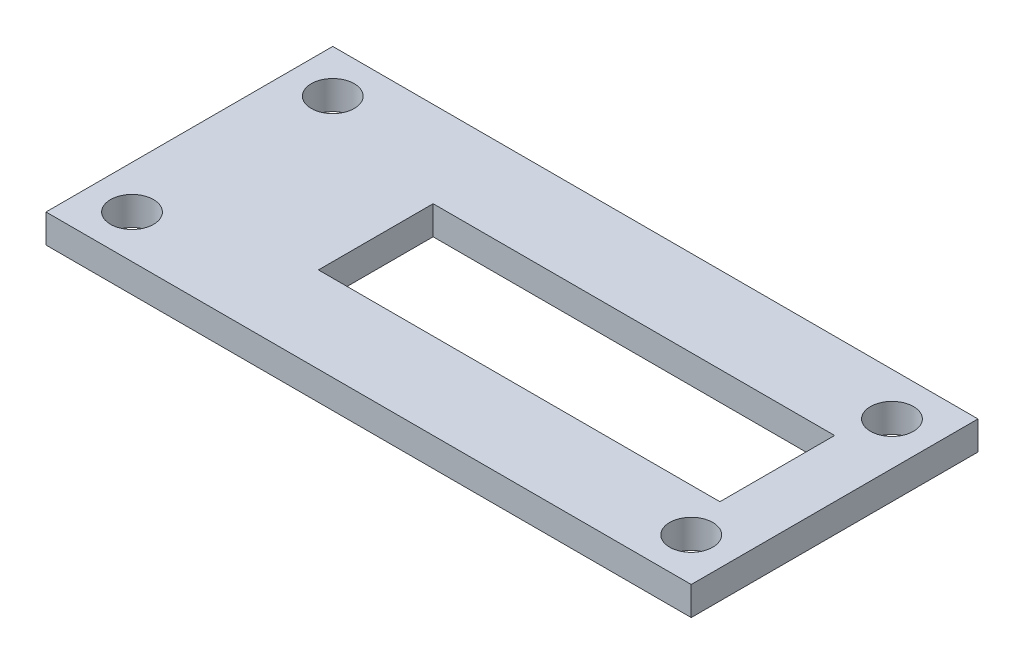
ISO-10303-21;
HEADER;
FILE_DESCRIPTION(('STEP AP214'),'2;1');
FILE_NAME('part.step','',(''),(''),'','','');
FILE_SCHEMA(('AUTOMOTIVE_DESIGN { 1 0 10303 214 1 1 1 1 }'));
ENDSEC;
DATA;
#1=APPLICATION_CONTEXT('core data for automotive mechanical design processes');
#2=APPLICATION_PROTOCOL_DEFINITION('international standard','automotive_design',2000,#1);
#3=PRODUCT_CONTEXT('',#1,'mechanical');
#4=PRODUCT('Part','Part','',(#3));
#5=PRODUCT_RELATED_PRODUCT_CATEGORY('part','',(#4));
#6=PRODUCT_DEFINITION_FORMATION('','',#4);
#7=PRODUCT_DEFINITION_CONTEXT('part definition',#1,'design');
#8=PRODUCT_DEFINITION('design','',#6,#7);
#9=PRODUCT_DEFINITION_SHAPE('','',#8);
#10=(LENGTH_UNIT() NAMED_UNIT(*) SI_UNIT(.MILLI.,.METRE.));
#11=(NAMED_UNIT(*) PLANE_ANGLE_UNIT() SI_UNIT($,.RADIAN.));
#12=(NAMED_UNIT(*) SI_UNIT($,.STERADIAN.) SOLID_ANGLE_UNIT());
#13=UNCERTAINTY_MEASURE_WITH_UNIT(LENGTH_MEASURE(1.E-05),#10,'distance_accuracy_value','');
#14=(GEOMETRIC_REPRESENTATION_CONTEXT(3) GLOBAL_UNCERTAINTY_ASSIGNED_CONTEXT((#13)) GLOBAL_UNIT_ASSIGNED_CONTEXT((#10,
#11,#12)) REPRESENTATION_CONTEXT('',''));
#15=CARTESIAN_POINT('',(0.,0.,0.));
#16=DIRECTION('',(0.,0.,1.));
#17=DIRECTION('',(1.,0.,0.));
#18=AXIS2_PLACEMENT_3D('',#15,#16,#17);
#19=CARTESIAN_POINT('',(22.5,2.,10.));
#20=DIRECTION('',(-1.,0.,0.));
#21=DIRECTION('',(0.,0.,1.));
#22=AXIS2_PLACEMENT_3D('',#19,#20,#21);
#23=PLANE('',#22);
#24=DIRECTION('',(0.,0.,-1.));
#25=VECTOR('',#24,1.);
#26=CARTESIAN_POINT('',(22.5,0.,10.));
#27=LINE('',#26,#25);
#28=CARTESIAN_POINT('',(22.5,0.,10.));
#29=VERTEX_POINT('',#28);
#30=CARTESIAN_POINT('',(22.5,0.,-10.));
#31=VERTEX_POINT('',#30);
#32=EDGE_CURVE('E155',#29,#31,#27,.T.);
#33=ORIENTED_EDGE('',*,*,#32,.T.);
#34=DIRECTION('',(0.,-1.,0.));
#35=VECTOR('',#34,1.);
#36=CARTESIAN_POINT('',(22.5,2.,-10.));
#37=LINE('',#36,#35);
#38=CARTESIAN_POINT('',(22.5,2.,-10.));
#39=VERTEX_POINT('',#38);
#40=EDGE_CURVE('E11',#39,#31,#37,.T.);
#41=ORIENTED_EDGE('',*,*,#40,.F.);
#42=DIRECTION('',(0.,0.,-1.));
#43=VECTOR('',#42,1.);
#44=CARTESIAN_POINT('',(22.5,2.,10.));
#45=LINE('',#44,#43);
#46=CARTESIAN_POINT('',(22.5,2.,10.));
#47=VERTEX_POINT('',#46);
#48=EDGE_CURVE('E158',#47,#39,#45,.T.);
#49=ORIENTED_EDGE('',*,*,#48,.F.);
#50=DIRECTION('',(0.,-1.,0.));
#51=VECTOR('',#50,1.);
#52=CARTESIAN_POINT('',(22.5,2.,10.));
#53=LINE('',#52,#51);
#54=EDGE_CURVE('E168',#47,#29,#53,.T.);
#55=ORIENTED_EDGE('',*,*,#54,.T.);
#56=EDGE_LOOP('',(#33,#41,#49,#55));
#57=FACE_BOUND('',#56,.T.);
#58=ADVANCED_FACE('F33',(#57),#23,.F.);
#59=CARTESIAN_POINT('',(-22.5,2.,-10.));
#60=DIRECTION('',(0.,0.,1.));
#61=DIRECTION('',(1.,0.,0.));
#62=AXIS2_PLACEMENT_3D('',#59,#60,#61);
#63=PLANE('',#62);
#64=DIRECTION('',(-1.,0.,0.));
#65=VECTOR('',#64,1.);
#66=CARTESIAN_POINT('',(-22.5,0.,-10.));
#67=LINE('',#66,#65);
#68=CARTESIAN_POINT('',(-22.5,0.,-10.));
#69=VERTEX_POINT('',#68);
#70=EDGE_CURVE('E171',#31,#69,#67,.T.);
#71=ORIENTED_EDGE('',*,*,#70,.T.);
#72=DIRECTION('',(0.,-1.,0.));
#73=VECTOR('',#72,1.);
#74=CARTESIAN_POINT('',(-22.5,2.,-10.));
#75=LINE('',#74,#73);
#76=CARTESIAN_POINT('',(-22.5,2.,-10.));
#77=VERTEX_POINT('',#76);
#78=EDGE_CURVE('E40',#77,#69,#75,.T.);
#79=ORIENTED_EDGE('',*,*,#78,.F.);
#80=DIRECTION('',(-1.,0.,0.));
#81=VECTOR('',#80,1.);
#82=CARTESIAN_POINT('',(-22.5,2.,-10.));
#83=LINE('',#82,#81);
#84=EDGE_CURVE('E161',#39,#77,#83,.T.);
#85=ORIENTED_EDGE('',*,*,#84,.F.);
#86=ORIENTED_EDGE('',*,*,#40,.T.);
#87=EDGE_LOOP('',(#71,#79,#85,#86));
#88=FACE_BOUND('',#87,.T.);
#89=ADVANCED_FACE('F200',(#88),#63,.F.);
#90=CARTESIAN_POINT('',(-22.5,2.,10.));
#91=DIRECTION('',(1.,0.,0.));
#92=DIRECTION('',(0.,0.,-1.));
#93=AXIS2_PLACEMENT_3D('',#90,#91,#92);
#94=PLANE('',#93);
#95=DIRECTION('',(0.,0.,1.));
#96=VECTOR('',#95,1.);
#97=CARTESIAN_POINT('',(-22.5,0.,10.));
#98=LINE('',#97,#96);
#99=CARTESIAN_POINT('',(-22.5,0.,10.));
#100=VERTEX_POINT('',#99);
#101=EDGE_CURVE('E173',#69,#100,#98,.T.);
#102=ORIENTED_EDGE('',*,*,#101,.T.);
#103=DIRECTION('',(0.,-1.,0.));
#104=VECTOR('',#103,1.);
#105=CARTESIAN_POINT('',(-22.5,2.,10.));
#106=LINE('',#105,#104);
#107=CARTESIAN_POINT('',(-22.5,2.,10.));
#108=VERTEX_POINT('',#107);
#109=EDGE_CURVE('E178',#108,#100,#106,.T.);
#110=ORIENTED_EDGE('',*,*,#109,.F.);
#111=DIRECTION('',(0.,0.,1.));
#112=VECTOR('',#111,1.);
#113=CARTESIAN_POINT('',(-22.5,2.,10.));
#114=LINE('',#113,#112);
#115=EDGE_CURVE('E164',#77,#108,#114,.T.);
#116=ORIENTED_EDGE('',*,*,#115,.F.);
#117=ORIENTED_EDGE('',*,*,#78,.T.);
#118=EDGE_LOOP('',(#102,#110,#116,#117));
#119=FACE_BOUND('',#118,.T.);
#120=ADVANCED_FACE('F185',(#119),#94,.F.);
#121=CARTESIAN_POINT('',(-22.5,2.,10.));
#122=DIRECTION('',(0.,0.,-1.));
#123=DIRECTION('',(-1.,0.,0.));
#124=AXIS2_PLACEMENT_3D('',#121,#122,#123);
#125=PLANE('',#124);
#126=DIRECTION('',(1.,0.,0.));
#127=VECTOR('',#126,1.);
#128=CARTESIAN_POINT('',(-22.5,0.,10.));
#129=LINE('',#128,#127);
#130=EDGE_CURVE('E162',#100,#29,#129,.T.);
#131=ORIENTED_EDGE('',*,*,#130,.T.);
#132=ORIENTED_EDGE('',*,*,#54,.F.);
#133=DIRECTION('',(1.,0.,0.));
#134=VECTOR('',#133,1.);
#135=CARTESIAN_POINT('',(-22.5,2.,10.));
#136=LINE('',#135,#134);
#137=EDGE_CURVE('E166',#108,#47,#136,.T.);
#138=ORIENTED_EDGE('',*,*,#137,.F.);
#139=ORIENTED_EDGE('',*,*,#109,.T.);
#140=EDGE_LOOP('',(#131,#132,#138,#139));
#141=FACE_BOUND('',#140,.T.);
#142=ADVANCED_FACE('F193',(#141),#125,.F.);
#143=CARTESIAN_POINT('',(0.,2.,0.));
#144=DIRECTION('',(0.,-1.,0.));
#145=DIRECTION('',(0.,0.,-1.));
#146=AXIS2_PLACEMENT_3D('',#143,#144,#145);
#147=PLANE('',#146);
#148=DIRECTION('',(0.,0.,1.));
#149=VECTOR('',#148,1.);
#150=CARTESIAN_POINT('',(-9.5,2.,-4.));
#151=LINE('',#150,#149);
#152=CARTESIAN_POINT('',(-9.5,2.,-4.));
#153=VERTEX_POINT('',#152);
#154=CARTESIAN_POINT('',(-9.5,2.,4.));
#155=VERTEX_POINT('',#154);
#156=EDGE_CURVE('E124',#153,#155,#151,.T.);
#157=ORIENTED_EDGE('',*,*,#156,.F.);
#158=DIRECTION('',(-1.,0.,0.));
#159=VECTOR('',#158,1.);
#160=CARTESIAN_POINT('',(18.5,2.,-4.));
#161=LINE('',#160,#159);
#162=CARTESIAN_POINT('',(18.5,2.,-4.));
#163=VERTEX_POINT('',#162);
#164=EDGE_CURVE('E47',#163,#153,#161,.T.);
#165=ORIENTED_EDGE('',*,*,#164,.F.);
#166=DIRECTION('',(0.,0.,-1.));
#167=VECTOR('',#166,1.);
#168=CARTESIAN_POINT('',(18.5,2.,4.));
#169=LINE('',#168,#167);
#170=CARTESIAN_POINT('',(18.5,2.,4.));
#171=VERTEX_POINT('',#170);
#172=EDGE_CURVE('E115',#171,#163,#169,.T.);
#173=ORIENTED_EDGE('',*,*,#172,.F.);
#174=DIRECTION('',(1.,0.,0.));
#175=VECTOR('',#174,1.);
#176=CARTESIAN_POINT('',(-9.5,2.,4.));
#177=LINE('',#176,#175);
#178=EDGE_CURVE('E118',#155,#171,#177,.T.);
#179=ORIENTED_EDGE('',*,*,#178,.F.);
#180=EDGE_LOOP('',(#157,#165,#173,#179));
#181=FACE_BOUND('',#180,.T.);
#182=CARTESIAN_POINT('',(19.5,2.,-7.));
#183=DIRECTION('',(0.,1.,0.));
#184=DIRECTION('',(0.,0.,-1.));
#185=AXIS2_PLACEMENT_3D('',#182,#183,#184);
#186=CIRCLE('',#185,1.5);
#187=CARTESIAN_POINT('',(19.5,2.,-8.5));
#188=VERTEX_POINT('',#187);
#189=EDGE_CURVE('E144',#188,#188,#186,.T.);
#190=ORIENTED_EDGE('',*,*,#189,.F.);
#191=EDGE_LOOP('',(#190));
#192=FACE_BOUND('',#191,.T.);
#193=CARTESIAN_POINT('',(-19.5,2.,7.));
#194=DIRECTION('',(0.,1.,0.));
#195=DIRECTION('',(0.,0.,-1.));
#196=AXIS2_PLACEMENT_3D('',#193,#194,#195);
#197=CIRCLE('',#196,1.5);
#198=CARTESIAN_POINT('',(-19.5,2.,5.5));
#199=VERTEX_POINT('',#198);
#200=EDGE_CURVE('E137',#199,#199,#197,.T.);
#201=ORIENTED_EDGE('',*,*,#200,.F.);
#202=EDGE_LOOP('',(#201));
#203=FACE_BOUND('',#202,.T.);
#204=CARTESIAN_POINT('',(19.5,2.,7.));
#205=DIRECTION('',(0.,1.,0.));
#206=DIRECTION('',(0.,0.,1.));
#207=AXIS2_PLACEMENT_3D('',#204,#205,#206);
#208=CIRCLE('',#207,1.5);
#209=CARTESIAN_POINT('',(19.5,2.,8.5));
#210=VERTEX_POINT('',#209);
#211=EDGE_CURVE('E130',#210,#210,#208,.T.);
#212=ORIENTED_EDGE('',*,*,#211,.F.);
#213=EDGE_LOOP('',(#212));
#214=FACE_BOUND('',#213,.T.);
#215=CARTESIAN_POINT('',(-19.5,2.,-7.));
#216=DIRECTION('',(0.,1.,0.));
#217=DIRECTION('',(0.,0.,1.));
#218=AXIS2_PLACEMENT_3D('',#215,#216,#217);
#219=CIRCLE('',#218,1.5);
#220=CARTESIAN_POINT('',(-19.5,2.,-5.5));
#221=VERTEX_POINT('',#220);
#222=EDGE_CURVE('E143',#221,#221,#219,.T.);
#223=ORIENTED_EDGE('',*,*,#222,.F.);
#224=EDGE_LOOP('',(#223));
#225=FACE_BOUND('',#224,.T.);
#226=ORIENTED_EDGE('',*,*,#48,.T.);
#227=ORIENTED_EDGE('',*,*,#84,.T.);
#228=ORIENTED_EDGE('',*,*,#115,.T.);
#229=ORIENTED_EDGE('',*,*,#137,.T.);
#230=EDGE_LOOP('',(#226,#227,#228,#229));
#231=FACE_BOUND('',#230,.T.);
#232=ADVANCED_FACE('F199',(#181,#192,#203,#214,#225,#231),#147,.F.);
#233=CARTESIAN_POINT('',(0.,0.,0.));
#234=DIRECTION('',(0.,-1.,0.));
#235=DIRECTION('',(0.,0.,-1.));
#236=AXIS2_PLACEMENT_3D('',#233,#234,#235);
#237=PLANE('',#236);
#238=DIRECTION('',(-1.,0.,0.));
#239=VECTOR('',#238,1.);
#240=CARTESIAN_POINT('',(18.5,0.,-4.));
#241=LINE('',#240,#239);
#242=CARTESIAN_POINT('',(18.5,0.,-4.));
#243=VERTEX_POINT('',#242);
#244=CARTESIAN_POINT('',(-9.5,0.,-4.));
#245=VERTEX_POINT('',#244);
#246=EDGE_CURVE('E99',#243,#245,#241,.T.);
#247=ORIENTED_EDGE('',*,*,#246,.T.);
#248=DIRECTION('',(0.,0.,1.));
#249=VECTOR('',#248,1.);
#250=CARTESIAN_POINT('',(-9.5,0.,-4.));
#251=LINE('',#250,#249);
#252=CARTESIAN_POINT('',(-9.5,0.,4.));
#253=VERTEX_POINT('',#252);
#254=EDGE_CURVE('E108',#245,#253,#251,.T.);
#255=ORIENTED_EDGE('',*,*,#254,.T.);
#256=DIRECTION('',(1.,0.,0.));
#257=VECTOR('',#256,1.);
#258=CARTESIAN_POINT('',(-9.5,0.,4.));
#259=LINE('',#258,#257);
#260=CARTESIAN_POINT('',(18.5,0.,4.));
#261=VERTEX_POINT('',#260);
#262=EDGE_CURVE('E55',#253,#261,#259,.T.);
#263=ORIENTED_EDGE('',*,*,#262,.T.);
#264=DIRECTION('',(0.,0.,-1.));
#265=VECTOR('',#264,1.);
#266=CARTESIAN_POINT('',(18.5,0.,4.));
#267=LINE('',#266,#265);
#268=EDGE_CURVE('E105',#261,#243,#267,.T.);
#269=ORIENTED_EDGE('',*,*,#268,.T.);
#270=EDGE_LOOP('',(#247,#255,#263,#269));
#271=FACE_BOUND('',#270,.T.);
#272=CARTESIAN_POINT('',(19.5,0.,-7.));
#273=DIRECTION('',(0.,1.,0.));
#274=DIRECTION('',(0.,0.,-1.));
#275=AXIS2_PLACEMENT_3D('',#272,#273,#274);
#276=CIRCLE('',#275,1.5);
#277=CARTESIAN_POINT('',(19.5,0.,-8.5));
#278=VERTEX_POINT('',#277);
#279=EDGE_CURVE('E140',#278,#278,#276,.T.);
#280=ORIENTED_EDGE('',*,*,#279,.T.);
#281=EDGE_LOOP('',(#280));
#282=FACE_BOUND('',#281,.T.);
#283=CARTESIAN_POINT('',(-19.5,0.,7.));
#284=DIRECTION('',(0.,1.,0.));
#285=DIRECTION('',(0.,0.,-1.));
#286=AXIS2_PLACEMENT_3D('',#283,#284,#285);
#287=CIRCLE('',#286,1.5);
#288=CARTESIAN_POINT('',(-19.5,0.,5.5));
#289=VERTEX_POINT('',#288);
#290=EDGE_CURVE('E147',#289,#289,#287,.T.);
#291=ORIENTED_EDGE('',*,*,#290,.T.);
#292=EDGE_LOOP('',(#291));
#293=FACE_BOUND('',#292,.T.);
#294=CARTESIAN_POINT('',(19.5,0.,7.));
#295=DIRECTION('',(0.,1.,0.));
#296=DIRECTION('',(0.,0.,1.));
#297=AXIS2_PLACEMENT_3D('',#294,#295,#296);
#298=CIRCLE('',#297,1.5);
#299=CARTESIAN_POINT('',(19.5,0.,8.5));
#300=VERTEX_POINT('',#299);
#301=EDGE_CURVE('E134',#300,#300,#298,.T.);
#302=ORIENTED_EDGE('',*,*,#301,.T.);
#303=EDGE_LOOP('',(#302));
#304=FACE_BOUND('',#303,.T.);
#305=CARTESIAN_POINT('',(-19.5,0.,-7.));
#306=DIRECTION('',(0.,1.,0.));
#307=DIRECTION('',(0.,0.,1.));
#308=AXIS2_PLACEMENT_3D('',#305,#306,#307);
#309=CIRCLE('',#308,1.5);
#310=CARTESIAN_POINT('',(-19.5,0.,-5.5));
#311=VERTEX_POINT('',#310);
#312=EDGE_CURVE('E152',#311,#311,#309,.T.);
#313=ORIENTED_EDGE('',*,*,#312,.T.);
#314=EDGE_LOOP('',(#313));
#315=FACE_BOUND('',#314,.T.);
#316=ORIENTED_EDGE('',*,*,#32,.F.);
#317=ORIENTED_EDGE('',*,*,#130,.F.);
#318=ORIENTED_EDGE('',*,*,#101,.F.);
#319=ORIENTED_EDGE('',*,*,#70,.F.);
#320=EDGE_LOOP('',(#316,#317,#318,#319));
#321=FACE_BOUND('',#320,.T.);
#322=ADVANCED_FACE('F112',(#271,#282,#293,#304,#315,#321),#237,.T.);
#323=CARTESIAN_POINT('',(-19.5,0.,-7.));
#324=DIRECTION('',(0.,1.,0.));
#325=DIRECTION('',(0.,0.,1.));
#326=AXIS2_PLACEMENT_3D('',#323,#324,#325);
#327=CYLINDRICAL_SURFACE('',#326,1.5);
#328=ORIENTED_EDGE('',*,*,#312,.F.);
#329=EDGE_LOOP('',(#328));
#330=FACE_BOUND('',#329,.T.);
#331=ORIENTED_EDGE('',*,*,#222,.T.);
#332=EDGE_LOOP('',(#331));
#333=FACE_BOUND('',#332,.T.);
#334=ADVANCED_FACE('F212',(#330,#333),#327,.F.);
#335=CARTESIAN_POINT('',(19.5,0.,7.));
#336=DIRECTION('',(0.,1.,0.));
#337=DIRECTION('',(0.,0.,1.));
#338=AXIS2_PLACEMENT_3D('',#335,#336,#337);
#339=CYLINDRICAL_SURFACE('',#338,1.5);
#340=ORIENTED_EDGE('',*,*,#301,.F.);
#341=EDGE_LOOP('',(#340));
#342=FACE_BOUND('',#341,.T.);
#343=ORIENTED_EDGE('',*,*,#211,.T.);
#344=EDGE_LOOP('',(#343));
#345=FACE_BOUND('',#344,.T.);
#346=ADVANCED_FACE('F218',(#342,#345),#339,.F.);
#347=CARTESIAN_POINT('',(-19.5,0.,7.));
#348=DIRECTION('',(0.,1.,0.));
#349=DIRECTION('',(0.,0.,1.));
#350=AXIS2_PLACEMENT_3D('',#347,#348,#349);
#351=CYLINDRICAL_SURFACE('',#350,1.5);
#352=ORIENTED_EDGE('',*,*,#290,.F.);
#353=EDGE_LOOP('',(#352));
#354=FACE_BOUND('',#353,.T.);
#355=ORIENTED_EDGE('',*,*,#200,.T.);
#356=EDGE_LOOP('',(#355));
#357=FACE_BOUND('',#356,.T.);
#358=ADVANCED_FACE('F220',(#354,#357),#351,.F.);
#359=CARTESIAN_POINT('',(19.5,0.,-7.));
#360=DIRECTION('',(0.,1.,0.));
#361=DIRECTION('',(0.,0.,1.));
#362=AXIS2_PLACEMENT_3D('',#359,#360,#361);
#363=CYLINDRICAL_SURFACE('',#362,1.5);
#364=ORIENTED_EDGE('',*,*,#279,.F.);
#365=EDGE_LOOP('',(#364));
#366=FACE_BOUND('',#365,.T.);
#367=ORIENTED_EDGE('',*,*,#189,.T.);
#368=EDGE_LOOP('',(#367));
#369=FACE_BOUND('',#368,.T.);
#370=ADVANCED_FACE('F223',(#366,#369),#363,.F.);
#371=CARTESIAN_POINT('',(18.5,0.,-4.));
#372=DIRECTION('',(0.,0.,-1.));
#373=DIRECTION('',(-1.,0.,0.));
#374=AXIS2_PLACEMENT_3D('',#371,#372,#373);
#375=PLANE('',#374);
#376=ORIENTED_EDGE('',*,*,#164,.T.);
#377=DIRECTION('',(0.,1.,0.));
#378=VECTOR('',#377,1.);
#379=CARTESIAN_POINT('',(-9.5,0.,-4.));
#380=LINE('',#379,#378);
#381=EDGE_CURVE('E95',#245,#153,#380,.T.);
#382=ORIENTED_EDGE('',*,*,#381,.F.);
#383=ORIENTED_EDGE('',*,*,#246,.F.);
#384=DIRECTION('',(0.,1.,0.));
#385=VECTOR('',#384,1.);
#386=CARTESIAN_POINT('',(18.5,0.,-4.));
#387=LINE('',#386,#385);
#388=EDGE_CURVE('E128',#243,#163,#387,.T.);
#389=ORIENTED_EDGE('',*,*,#388,.T.);
#390=EDGE_LOOP('',(#376,#382,#383,#389));
#391=FACE_BOUND('',#390,.T.);
#392=ADVANCED_FACE('F97',(#391),#375,.F.);
#393=CARTESIAN_POINT('',(18.5,0.,4.));
#394=DIRECTION('',(1.,0.,0.));
#395=DIRECTION('',(0.,0.,-1.));
#396=AXIS2_PLACEMENT_3D('',#393,#394,#395);
#397=PLANE('',#396);
#398=ORIENTED_EDGE('',*,*,#172,.T.);
#399=ORIENTED_EDGE('',*,*,#388,.F.);
#400=ORIENTED_EDGE('',*,*,#268,.F.);
#401=DIRECTION('',(0.,1.,0.));
#402=VECTOR('',#401,1.);
#403=CARTESIAN_POINT('',(18.5,0.,4.));
#404=LINE('',#403,#402);
#405=EDGE_CURVE('E131',#261,#171,#404,.T.);
#406=ORIENTED_EDGE('',*,*,#405,.T.);
#407=EDGE_LOOP('',(#398,#399,#400,#406));
#408=FACE_BOUND('',#407,.T.);
#409=ADVANCED_FACE('F233',(#408),#397,.F.);
#410=CARTESIAN_POINT('',(-9.5,0.,4.));
#411=DIRECTION('',(0.,0.,1.));
#412=DIRECTION('',(1.,0.,0.));
#413=AXIS2_PLACEMENT_3D('',#410,#411,#412);
#414=PLANE('',#413);
#415=ORIENTED_EDGE('',*,*,#178,.T.);
#416=ORIENTED_EDGE('',*,*,#405,.F.);
#417=ORIENTED_EDGE('',*,*,#262,.F.);
#418=DIRECTION('',(0.,1.,0.));
#419=VECTOR('',#418,1.);
#420=CARTESIAN_POINT('',(-9.5,0.,4.));
#421=LINE('',#420,#419);
#422=EDGE_CURVE('E104',#253,#155,#421,.T.);
#423=ORIENTED_EDGE('',*,*,#422,.T.);
#424=EDGE_LOOP('',(#415,#416,#417,#423));
#425=FACE_BOUND('',#424,.T.);
#426=ADVANCED_FACE('F236',(#425),#414,.F.);
#427=CARTESIAN_POINT('',(-9.5,0.,-4.));
#428=DIRECTION('',(-1.,0.,0.));
#429=DIRECTION('',(0.,0.,1.));
#430=AXIS2_PLACEMENT_3D('',#427,#428,#429);
#431=PLANE('',#430);
#432=ORIENTED_EDGE('',*,*,#156,.T.);
#433=ORIENTED_EDGE('',*,*,#422,.F.);
#434=ORIENTED_EDGE('',*,*,#254,.F.);
#435=ORIENTED_EDGE('',*,*,#381,.T.);
#436=EDGE_LOOP('',(#432,#433,#434,#435));
#437=FACE_BOUND('',#436,.T.);
#438=ADVANCED_FACE('F109',(#437),#431,.F.);
#439=CLOSED_SHELL('',(#58,#89,#120,#142,#232,#322,#334,#346,#358,#370,#392,#409,#426,#438));
#440=MANIFOLD_SOLID_BREP('B2',#439);
#441=ADVANCED_BREP_SHAPE_REPRESENTATION('',(#18,#440),#14);
#442=SHAPE_DEFINITION_REPRESENTATION(#9,#441);
ENDSEC;
END-ISO-10303-21;
